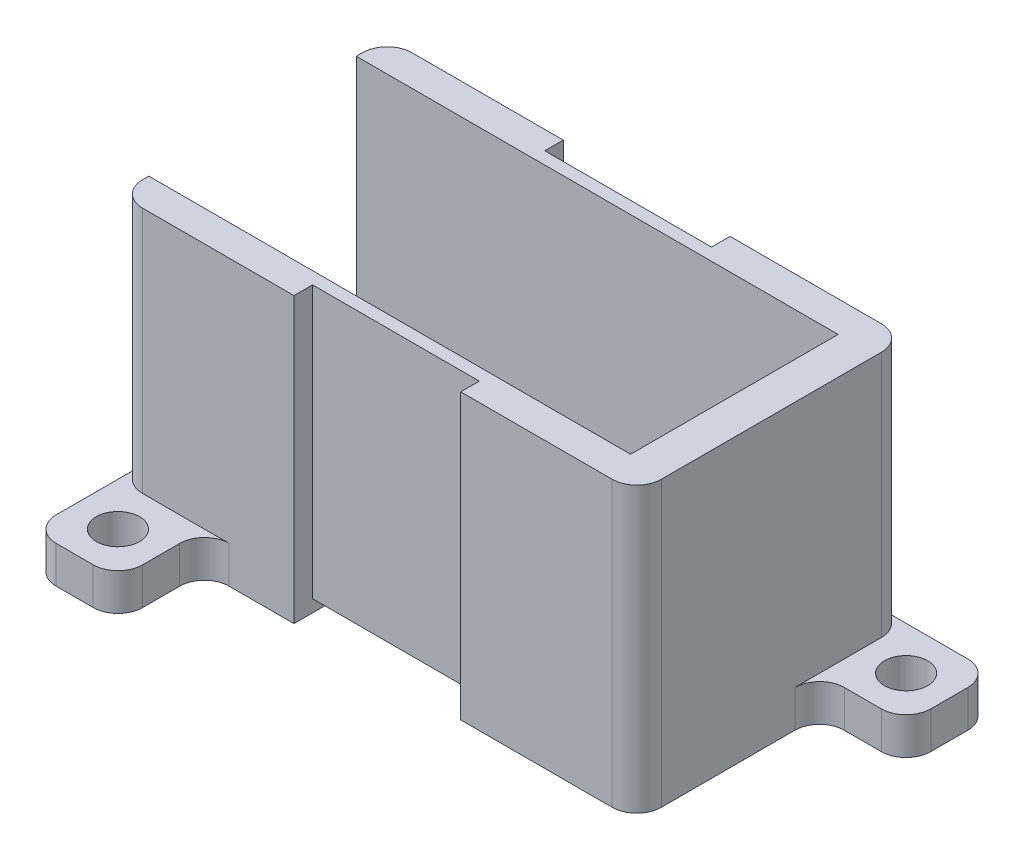
ISO-10303-21;
HEADER;
FILE_DESCRIPTION(('STEP AP214'),'2;1');
FILE_NAME('part.step','',(''),(''),'','','');
FILE_SCHEMA(('AUTOMOTIVE_DESIGN { 1 0 10303 214 1 1 1 1 }'));
ENDSEC;
DATA;
#1=APPLICATION_CONTEXT('core data for automotive mechanical design processes');
#2=APPLICATION_PROTOCOL_DEFINITION('international standard','automotive_design',2000,#1);
#3=PRODUCT_CONTEXT('',#1,'mechanical');
#4=PRODUCT('Part','Part','',(#3));
#5=PRODUCT_RELATED_PRODUCT_CATEGORY('part','',(#4));
#6=PRODUCT_DEFINITION_FORMATION('','',#4);
#7=PRODUCT_DEFINITION_CONTEXT('part definition',#1,'design');
#8=PRODUCT_DEFINITION('design','',#6,#7);
#9=PRODUCT_DEFINITION_SHAPE('','',#8);
#10=(LENGTH_UNIT() NAMED_UNIT(*) SI_UNIT(.MILLI.,.METRE.));
#11=(NAMED_UNIT(*) PLANE_ANGLE_UNIT() SI_UNIT($,.RADIAN.));
#12=(NAMED_UNIT(*) SI_UNIT($,.STERADIAN.) SOLID_ANGLE_UNIT());
#13=UNCERTAINTY_MEASURE_WITH_UNIT(LENGTH_MEASURE(1.E-05),#10,'distance_accuracy_value','');
#14=(GEOMETRIC_REPRESENTATION_CONTEXT(3) GLOBAL_UNCERTAINTY_ASSIGNED_CONTEXT((#13)) GLOBAL_UNIT_ASSIGNED_CONTEXT((#10,
#11,#12)) REPRESENTATION_CONTEXT('',''));
#15=CARTESIAN_POINT('',(0.,0.,0.));
#16=DIRECTION('',(0.,0.,1.));
#17=DIRECTION('',(1.,0.,0.));
#18=AXIS2_PLACEMENT_3D('',#15,#16,#17);
#19=CARTESIAN_POINT('',(33.,3.,0.));
#20=DIRECTION('',(-1.,0.,0.));
#21=DIRECTION('',(0.,0.,1.));
#22=AXIS2_PLACEMENT_3D('',#19,#20,#21);
#23=PLANE('',#22);
#24=DIRECTION('',(0.,0.,1.));
#25=VECTOR('',#24,1.);
#26=CARTESIAN_POINT('',(33.,23.,0.));
#27=LINE('',#26,#25);
#28=CARTESIAN_POINT('',(33.,23.,-28.4));
#29=VERTEX_POINT('',#28);
#30=CARTESIAN_POINT('',(33.,23.,-10.6));
#31=VERTEX_POINT('',#30);
#32=EDGE_CURVE('E477',#29,#31,#27,.T.);
#33=ORIENTED_EDGE('',*,*,#32,.T.);
#34=DIRECTION('',(0.,-1.,0.));
#35=VECTOR('',#34,1.);
#36=CARTESIAN_POINT('',(33.,3.,-10.6));
#37=LINE('',#36,#35);
#38=CARTESIAN_POINT('',(33.,0.,-10.6));
#39=VERTEX_POINT('',#38);
#40=EDGE_CURVE('E347',#31,#39,#37,.T.);
#41=ORIENTED_EDGE('',*,*,#40,.T.);
#42=DIRECTION('',(0.,0.,-1.));
#43=VECTOR('',#42,1.);
#44=CARTESIAN_POINT('',(33.,0.,0.));
#45=LINE('',#44,#43);
#46=CARTESIAN_POINT('',(33.,0.,-21.4));
#47=VERTEX_POINT('',#46);
#48=EDGE_CURVE('E278',#39,#47,#45,.T.);
#49=ORIENTED_EDGE('',*,*,#48,.T.);
#50=DIRECTION('',(0.,-1.,0.));
#51=VECTOR('',#50,1.);
#52=CARTESIAN_POINT('',(33.,3.,-21.4));
#53=LINE('',#52,#51);
#54=CARTESIAN_POINT('',(33.,3.,-21.4));
#55=VERTEX_POINT('',#54);
#56=EDGE_CURVE('E342',#47,#55,#53,.F.);
#57=ORIENTED_EDGE('',*,*,#56,.T.);
#58=DIRECTION('',(0.,0.,-1.));
#59=VECTOR('',#58,1.);
#60=CARTESIAN_POINT('',(33.,3.,0.));
#61=LINE('',#60,#59);
#62=CARTESIAN_POINT('',(33.,3.,-28.4));
#63=VERTEX_POINT('',#62);
#64=EDGE_CURVE('E404',#55,#63,#61,.T.);
#65=ORIENTED_EDGE('',*,*,#64,.T.);
#66=DIRECTION('',(0.,-1.,0.));
#67=VECTOR('',#66,1.);
#68=CARTESIAN_POINT('',(33.,23.,-28.4));
#69=LINE('',#68,#67);
#70=EDGE_CURVE('E345',#63,#29,#69,.F.);
#71=ORIENTED_EDGE('',*,*,#70,.T.);
#72=EDGE_LOOP('',(#33,#41,#49,#57,#65,#71));
#73=FACE_BOUND('',#72,.T.);
#74=ADVANCED_FACE('F43',(#73),#23,.F.);
#75=CARTESIAN_POINT('',(0.,3.,-8.6));
#76=DIRECTION('',(0.,0.,-1.));
#77=DIRECTION('',(-1.,0.,0.));
#78=AXIS2_PLACEMENT_3D('',#75,#76,#77);
#79=PLANE('',#78);
#80=DIRECTION('',(-1.,0.,0.));
#81=VECTOR('',#80,1.);
#82=CARTESIAN_POINT('',(0.,23.,-8.6));
#83=LINE('',#82,#81);
#84=CARTESIAN_POINT('',(5.25,23.,-8.6));
#85=VERTEX_POINT('',#84);
#86=CARTESIAN_POINT('',(-7.00000000000001,23.,-8.6));
#87=VERTEX_POINT('',#86);
#88=EDGE_CURVE('E464',#85,#87,#83,.T.);
#89=ORIENTED_EDGE('',*,*,#88,.T.);
#90=DIRECTION('',(0.,-1.,0.));
#91=VECTOR('',#90,1.);
#92=CARTESIAN_POINT('',(-7.00000000000001,3.,-8.6));
#93=LINE('',#92,#91);
#94=CARTESIAN_POINT('',(-7.00000000000001,3.,-8.6));
#95=VERTEX_POINT('',#94);
#96=EDGE_CURVE('E325',#87,#95,#93,.T.);
#97=ORIENTED_EDGE('',*,*,#96,.T.);
#98=DIRECTION('',(-1.,0.,0.));
#99=VECTOR('',#98,1.);
#100=CARTESIAN_POINT('',(0.,3.,-8.6));
#101=LINE('',#100,#99);
#102=CARTESIAN_POINT('',(0.,3.,-8.6));
#103=VERTEX_POINT('',#102);
#104=EDGE_CURVE('E262',#103,#95,#101,.T.);
#105=ORIENTED_EDGE('',*,*,#104,.F.);
#106=DIRECTION('',(0.,-1.,0.));
#107=VECTOR('',#106,1.);
#108=CARTESIAN_POINT('',(0.,0.,-8.6));
#109=LINE('',#108,#107);
#110=CARTESIAN_POINT('',(0.,0.,-8.6));
#111=VERTEX_POINT('',#110);
#112=EDGE_CURVE('E322',#103,#111,#109,.T.);
#113=ORIENTED_EDGE('',*,*,#112,.T.);
#114=DIRECTION('',(1.,0.,0.));
#115=VECTOR('',#114,1.);
#116=CARTESIAN_POINT('',(0.,0.,-8.6));
#117=LINE('',#116,#115);
#118=CARTESIAN_POINT('',(5.25,0.,-8.6));
#119=VERTEX_POINT('',#118);
#120=EDGE_CURVE('E291',#111,#119,#117,.T.);
#121=ORIENTED_EDGE('',*,*,#120,.T.);
#122=DIRECTION('',(0.,-1.,0.));
#123=VECTOR('',#122,1.);
#124=CARTESIAN_POINT('',(5.25,23.,-8.6));
#125=LINE('',#124,#123);
#126=EDGE_CURVE('E500',#85,#119,#125,.T.);
#127=ORIENTED_EDGE('',*,*,#126,.F.);
#128=EDGE_LOOP('',(#89,#97,#105,#113,#121,#127));
#129=FACE_BOUND('',#128,.T.);
#130=ADVANCED_FACE('F575',(#129),#79,.F.);
#131=CARTESIAN_POINT('',(0.,0.,0.));
#132=DIRECTION('',(0.,1.,0.));
#133=DIRECTION('',(0.,0.,1.));
#134=AXIS2_PLACEMENT_3D('',#131,#132,#133);
#135=PLANE('',#134);
#136=DIRECTION('',(0.,0.,1.));
#137=VECTOR('',#136,1.);
#138=CARTESIAN_POINT('',(-9.00000000000001,0.,0.));
#139=LINE('',#138,#137);
#140=CARTESIAN_POINT('',(-9.,0.,-28.4));
#141=VERTEX_POINT('',#140);
#142=CARTESIAN_POINT('',(-9.00000000000001,0.,-3.6));
#143=VERTEX_POINT('',#142);
#144=EDGE_CURVE('E295',#141,#143,#139,.T.);
#145=ORIENTED_EDGE('',*,*,#144,.F.);
#146=CARTESIAN_POINT('',(-7.,0.,-28.4));
#147=DIRECTION('',(0.,1.,0.));
#148=DIRECTION('',(0.,0.,1.));
#149=AXIS2_PLACEMENT_3D('',#146,#147,#148);
#150=CIRCLE('',#149,2.);
#151=CARTESIAN_POINT('',(-7.,0.,-30.4));
#152=VERTEX_POINT('',#151);
#153=EDGE_CURVE('E310',#141,#152,#150,.F.);
#154=ORIENTED_EDGE('',*,*,#153,.T.);
#155=DIRECTION('',(1.,0.,0.));
#156=VECTOR('',#155,1.);
#157=CARTESIAN_POINT('',(0.,0.,-30.4));
#158=LINE('',#157,#156);
#159=CARTESIAN_POINT('',(5.25,0.,-30.4));
#160=VERTEX_POINT('',#159);
#161=EDGE_CURVE('E293',#152,#160,#158,.T.);
#162=ORIENTED_EDGE('',*,*,#161,.T.);
#163=DIRECTION('',(0.,0.,-1.));
#164=VECTOR('',#163,1.);
#165=CARTESIAN_POINT('',(5.25,0.,0.));
#166=LINE('',#165,#164);
#167=EDGE_CURVE('E442',#119,#160,#166,.T.);
#168=ORIENTED_EDGE('',*,*,#167,.F.);
#169=ORIENTED_EDGE('',*,*,#120,.F.);
#170=CARTESIAN_POINT('',(0.,0.,-6.6));
#171=DIRECTION('',(0.,1.,0.));
#172=DIRECTION('',(0.,0.,1.));
#173=AXIS2_PLACEMENT_3D('',#170,#171,#172);
#174=CIRCLE('',#173,2.);
#175=CARTESIAN_POINT('',(-2.00000000000001,0.,-6.6));
#176=VERTEX_POINT('',#175);
#177=EDGE_CURVE('E380',#111,#176,#174,.T.);
#178=ORIENTED_EDGE('',*,*,#177,.T.);
#179=DIRECTION('',(0.,0.,-1.));
#180=VECTOR('',#179,1.);
#181=CARTESIAN_POINT('',(-2.00000000000001,0.,0.));
#182=LINE('',#181,#180);
#183=CARTESIAN_POINT('',(-2.00000000000001,0.,-3.6));
#184=VERTEX_POINT('',#183);
#185=EDGE_CURVE('E417',#184,#176,#182,.T.);
#186=ORIENTED_EDGE('',*,*,#185,.F.);
#187=CARTESIAN_POINT('',(-4.00000000000001,0.,-3.6));
#188=DIRECTION('',(0.,1.,0.));
#189=DIRECTION('',(0.,0.,1.));
#190=AXIS2_PLACEMENT_3D('',#187,#188,#189);
#191=CIRCLE('',#190,2.);
#192=CARTESIAN_POINT('',(-4.00000000000001,0.,-1.6));
#193=VERTEX_POINT('',#192);
#194=EDGE_CURVE('E306',#184,#193,#191,.F.);
#195=ORIENTED_EDGE('',*,*,#194,.T.);
#196=DIRECTION('',(-1.,0.,0.));
#197=VECTOR('',#196,1.);
#198=CARTESIAN_POINT('',(0.,0.,-1.6));
#199=LINE('',#198,#197);
#200=CARTESIAN_POINT('',(-7.00000000000001,0.,-1.6));
#201=VERTEX_POINT('',#200);
#202=EDGE_CURVE('E422',#193,#201,#199,.T.);
#203=ORIENTED_EDGE('',*,*,#202,.T.);
#204=CARTESIAN_POINT('',(-7.00000000000001,0.,-3.6));
#205=DIRECTION('',(0.,1.,0.));
#206=DIRECTION('',(0.,0.,1.));
#207=AXIS2_PLACEMENT_3D('',#204,#205,#206);
#208=CIRCLE('',#207,2.);
#209=EDGE_CURVE('E308',#201,#143,#208,.F.);
#210=ORIENTED_EDGE('',*,*,#209,.T.);
#211=EDGE_LOOP('',(#145,#154,#162,#168,#169,#178,#186,#195,#203,#210));
#212=FACE_BOUND('',#211,.T.);
#213=CARTESIAN_POINT('',(-5.50000000000001,0.,-5.1));
#214=DIRECTION('',(0.,1.,0.));
#215=DIRECTION('',(0.,0.,1.));
#216=AXIS2_PLACEMENT_3D('',#213,#214,#215);
#217=CIRCLE('',#216,1.75);
#218=CARTESIAN_POINT('',(-5.50000000000001,0.,-3.35));
#219=VERTEX_POINT('',#218);
#220=EDGE_CURVE('E426',#219,#219,#217,.T.);
#221=ORIENTED_EDGE('',*,*,#220,.T.);
#222=EDGE_LOOP('',(#221));
#223=FACE_BOUND('',#222,.T.);
#224=ADVANCED_FACE('F544',(#212,#223),#135,.F.);
#225=ORIENTED_EDGE('',*,*,#48,.F.);
#226=CARTESIAN_POINT('',(31.,0.,-10.6));
#227=DIRECTION('',(0.,1.,0.));
#228=DIRECTION('',(0.,0.,1.));
#229=AXIS2_PLACEMENT_3D('',#226,#227,#228);
#230=CIRCLE('',#229,2.);
#231=CARTESIAN_POINT('',(31.,0.,-8.6));
#232=VERTEX_POINT('',#231);
#233=EDGE_CURVE('E354',#39,#232,#230,.F.);
#234=ORIENTED_EDGE('',*,*,#233,.T.);
#235=CARTESIAN_POINT('',(18.75,0.,-8.6));
#236=VERTEX_POINT('',#235);
#237=EDGE_CURVE('E298',#236,#232,#117,.T.);
#238=ORIENTED_EDGE('',*,*,#237,.F.);
#239=DIRECTION('',(0.,0.,-1.));
#240=VECTOR('',#239,1.);
#241=CARTESIAN_POINT('',(18.75,0.,0.));
#242=LINE('',#241,#240);
#243=CARTESIAN_POINT('',(18.75,0.,-30.4));
#244=VERTEX_POINT('',#243);
#245=EDGE_CURVE('E272',#236,#244,#242,.T.);
#246=ORIENTED_EDGE('',*,*,#245,.T.);
#247=CARTESIAN_POINT('',(38.,0.,-30.4));
#248=VERTEX_POINT('',#247);
#249=EDGE_CURVE('E282',#244,#248,#158,.T.);
#250=ORIENTED_EDGE('',*,*,#249,.T.);
#251=CARTESIAN_POINT('',(38.,0.,-28.4));
#252=DIRECTION('',(0.,1.,0.));
#253=DIRECTION('',(0.,0.,1.));
#254=AXIS2_PLACEMENT_3D('',#251,#252,#253);
#255=CIRCLE('',#254,2.);
#256=CARTESIAN_POINT('',(40.,0.,-28.4));
#257=VERTEX_POINT('',#256);
#258=EDGE_CURVE('E350',#248,#257,#255,.F.);
#259=ORIENTED_EDGE('',*,*,#258,.T.);
#260=DIRECTION('',(0.,0.,-1.));
#261=VECTOR('',#260,1.);
#262=CARTESIAN_POINT('',(40.,0.,0.));
#263=LINE('',#262,#261);
#264=CARTESIAN_POINT('',(40.,0.,-25.4));
#265=VERTEX_POINT('',#264);
#266=EDGE_CURVE('E403',#265,#257,#263,.T.);
#267=ORIENTED_EDGE('',*,*,#266,.F.);
#268=CARTESIAN_POINT('',(38.,0.,-25.4));
#269=DIRECTION('',(0.,1.,0.));
#270=DIRECTION('',(0.,0.,1.));
#271=AXIS2_PLACEMENT_3D('',#268,#269,#270);
#272=CIRCLE('',#271,2.);
#273=CARTESIAN_POINT('',(38.,0.,-23.4));
#274=VERTEX_POINT('',#273);
#275=EDGE_CURVE('E352',#265,#274,#272,.F.);
#276=ORIENTED_EDGE('',*,*,#275,.T.);
#277=DIRECTION('',(-1.,0.,0.));
#278=VECTOR('',#277,1.);
#279=CARTESIAN_POINT('',(0.,0.,-23.4));
#280=LINE('',#279,#278);
#281=CARTESIAN_POINT('',(35.,0.,-23.4));
#282=VERTEX_POINT('',#281);
#283=EDGE_CURVE('E391',#274,#282,#280,.T.);
#284=ORIENTED_EDGE('',*,*,#283,.T.);
#285=CARTESIAN_POINT('',(35.,0.,-21.4));
#286=DIRECTION('',(0.,1.,0.));
#287=DIRECTION('',(0.,0.,1.));
#288=AXIS2_PLACEMENT_3D('',#285,#286,#287);
#289=CIRCLE('',#288,2.);
#290=EDGE_CURVE('E51',#282,#47,#289,.T.);
#291=ORIENTED_EDGE('',*,*,#290,.T.);
#292=EDGE_LOOP('',(#225,#234,#238,#246,#250,#259,#267,#276,#284,#291));
#293=FACE_BOUND('',#292,.T.);
#294=CARTESIAN_POINT('',(36.5,0.,-26.9));
#295=DIRECTION('',(0.,1.,0.));
#296=DIRECTION('',(0.,0.,1.));
#297=AXIS2_PLACEMENT_3D('',#294,#295,#296);
#298=CIRCLE('',#297,1.75);
#299=CARTESIAN_POINT('',(36.5,0.,-25.15));
#300=VERTEX_POINT('',#299);
#301=EDGE_CURVE('E621',#300,#300,#298,.T.);
#302=ORIENTED_EDGE('',*,*,#301,.T.);
#303=EDGE_LOOP('',(#302));
#304=FACE_BOUND('',#303,.T.);
#305=ADVANCED_FACE('F389',(#293,#304),#135,.F.);
#306=CARTESIAN_POINT('',(0.,3.,-30.4));
#307=DIRECTION('',(0.,0.,-1.));
#308=DIRECTION('',(-1.,0.,0.));
#309=AXIS2_PLACEMENT_3D('',#306,#307,#308);
#310=PLANE('',#309);
#311=ORIENTED_EDGE('',*,*,#161,.F.);
#312=DIRECTION('',(0.,-1.,0.));
#313=VECTOR('',#312,1.);
#314=CARTESIAN_POINT('',(-7.,23.,-30.4));
#315=LINE('',#314,#313);
#316=CARTESIAN_POINT('',(-7.,23.,-30.4));
#317=VERTEX_POINT('',#316);
#318=EDGE_CURVE('E312',#152,#317,#315,.F.);
#319=ORIENTED_EDGE('',*,*,#318,.T.);
#320=DIRECTION('',(-1.,0.,0.));
#321=VECTOR('',#320,1.);
#322=CARTESIAN_POINT('',(0.,23.,-30.4));
#323=LINE('',#322,#321);
#324=CARTESIAN_POINT('',(5.25,23.,-30.4));
#325=VERTEX_POINT('',#324);
#326=EDGE_CURVE('E450',#325,#317,#323,.T.);
#327=ORIENTED_EDGE('',*,*,#326,.F.);
#328=DIRECTION('',(0.,-1.,0.));
#329=VECTOR('',#328,1.);
#330=CARTESIAN_POINT('',(5.25,23.,-30.4));
#331=LINE('',#330,#329);
#332=EDGE_CURVE('E279',#325,#160,#331,.T.);
#333=ORIENTED_EDGE('',*,*,#332,.T.);
#334=EDGE_LOOP('',(#311,#319,#327,#333));
#335=FACE_BOUND('',#334,.T.);
#336=ADVANCED_FACE('F804',(#335),#310,.T.);
#337=ORIENTED_EDGE('',*,*,#237,.T.);
#338=DIRECTION('',(0.,-1.,0.));
#339=VECTOR('',#338,1.);
#340=CARTESIAN_POINT('',(31.,3.,-8.6));
#341=LINE('',#340,#339);
#342=CARTESIAN_POINT('',(31.,23.,-8.6));
#343=VERTEX_POINT('',#342);
#344=EDGE_CURVE('E356',#232,#343,#341,.F.);
#345=ORIENTED_EDGE('',*,*,#344,.T.);
#346=DIRECTION('',(-1.,0.,0.));
#347=VECTOR('',#346,1.);
#348=CARTESIAN_POINT('',(0.,23.,-8.6));
#349=LINE('',#348,#347);
#350=CARTESIAN_POINT('',(18.75,23.,-8.6));
#351=VERTEX_POINT('',#350);
#352=EDGE_CURVE('E475',#343,#351,#349,.T.);
#353=ORIENTED_EDGE('',*,*,#352,.T.);
#354=DIRECTION('',(0.,-1.,0.));
#355=VECTOR('',#354,1.);
#356=CARTESIAN_POINT('',(18.75,23.,-8.6));
#357=LINE('',#356,#355);
#358=EDGE_CURVE('E493',#351,#236,#357,.T.);
#359=ORIENTED_EDGE('',*,*,#358,.T.);
#360=EDGE_LOOP('',(#337,#345,#353,#359));
#361=FACE_BOUND('',#360,.T.);
#362=ADVANCED_FACE('F594',(#361),#79,.F.);
#363=CARTESIAN_POINT('',(0.,3.,0.));
#364=DIRECTION('',(0.,1.,0.));
#365=DIRECTION('',(0.,0.,1.));
#366=AXIS2_PLACEMENT_3D('',#363,#364,#365);
#367=PLANE('',#366);
#368=DIRECTION('',(-1.,0.,0.));
#369=VECTOR('',#368,1.);
#370=CARTESIAN_POINT('',(0.,3.,-11.1));
#371=LINE('',#370,#369);
#372=CARTESIAN_POINT('',(30.,3.,-11.1));
#373=VERTEX_POINT('',#372);
#374=CARTESIAN_POINT('',(-9.00000000000001,3.,-11.1));
#375=VERTEX_POINT('',#374);
#376=EDGE_CURVE('E448',#373,#375,#371,.T.);
#377=ORIENTED_EDGE('',*,*,#376,.F.);
#378=DIRECTION('',(0.,0.,1.));
#379=VECTOR('',#378,1.);
#380=CARTESIAN_POINT('',(30.,3.,0.));
#381=LINE('',#380,#379);
#382=CARTESIAN_POINT('',(30.,3.,-27.9));
#383=VERTEX_POINT('',#382);
#384=EDGE_CURVE('E485',#383,#373,#381,.T.);
#385=ORIENTED_EDGE('',*,*,#384,.F.);
#386=DIRECTION('',(1.,0.,0.));
#387=VECTOR('',#386,1.);
#388=CARTESIAN_POINT('',(0.,3.,-27.9));
#389=LINE('',#388,#387);
#390=CARTESIAN_POINT('',(-9.,3.,-27.9));
#391=VERTEX_POINT('',#390);
#392=EDGE_CURVE('E445',#391,#383,#389,.T.);
#393=ORIENTED_EDGE('',*,*,#392,.F.);
#394=DIRECTION('',(0.,0.,1.));
#395=VECTOR('',#394,1.);
#396=CARTESIAN_POINT('',(-9.00000000000001,3.,0.));
#397=LINE('',#396,#395);
#398=EDGE_CURVE('E289',#391,#375,#397,.T.);
#399=ORIENTED_EDGE('',*,*,#398,.T.);
#400=EDGE_LOOP('',(#377,#385,#393,#399));
#401=FACE_BOUND('',#400,.T.);
#402=ADVANCED_FACE('F524',(#401),#367,.T.);
#403=DIRECTION('',(-1.,0.,0.));
#404=VECTOR('',#403,1.);
#405=CARTESIAN_POINT('',(0.,23.,-30.4));
#406=LINE('',#405,#404);
#407=CARTESIAN_POINT('',(31.,23.,-30.4));
#408=VERTEX_POINT('',#407);
#409=CARTESIAN_POINT('',(18.75,23.,-30.4));
#410=VERTEX_POINT('',#409);
#411=EDGE_CURVE('E479',#408,#410,#406,.T.);
#412=ORIENTED_EDGE('',*,*,#411,.F.);
#413=DIRECTION('',(0.,-1.,0.));
#414=VECTOR('',#413,1.);
#415=CARTESIAN_POINT('',(31.,3.,-30.4));
#416=LINE('',#415,#414);
#417=CARTESIAN_POINT('',(31.,3.,-30.4));
#418=VERTEX_POINT('',#417);
#419=EDGE_CURVE('E361',#408,#418,#416,.T.);
#420=ORIENTED_EDGE('',*,*,#419,.T.);
#421=DIRECTION('',(-1.,0.,0.));
#422=VECTOR('',#421,1.);
#423=CARTESIAN_POINT('',(0.,3.,-30.4));
#424=LINE('',#423,#422);
#425=CARTESIAN_POINT('',(38.,3.,-30.4));
#426=VERTEX_POINT('',#425);
#427=EDGE_CURVE('E414',#426,#418,#424,.T.);
#428=ORIENTED_EDGE('',*,*,#427,.F.);
#429=DIRECTION('',(0.,-1.,0.));
#430=VECTOR('',#429,1.);
#431=CARTESIAN_POINT('',(38.,0.,-30.4));
#432=LINE('',#431,#430);
#433=EDGE_CURVE('E358',#426,#248,#432,.T.);
#434=ORIENTED_EDGE('',*,*,#433,.T.);
#435=ORIENTED_EDGE('',*,*,#249,.F.);
#436=DIRECTION('',(0.,-1.,0.));
#437=VECTOR('',#436,1.);
#438=CARTESIAN_POINT('',(18.75,23.,-30.4));
#439=LINE('',#438,#437);
#440=EDGE_CURVE('E491',#410,#244,#439,.T.);
#441=ORIENTED_EDGE('',*,*,#440,.F.);
#442=EDGE_LOOP('',(#412,#420,#428,#434,#435,#441));
#443=FACE_BOUND('',#442,.T.);
#444=ADVANCED_FACE('F605',(#443),#310,.T.);
#445=CARTESIAN_POINT('',(-9.00000000000001,3.,0.));
#446=DIRECTION('',(1.,0.,0.));
#447=DIRECTION('',(0.,0.,-1.));
#448=AXIS2_PLACEMENT_3D('',#445,#446,#447);
#449=PLANE('',#448);
#450=DIRECTION('',(0.,0.,1.));
#451=VECTOR('',#450,1.);
#452=CARTESIAN_POINT('',(-8.99999999999994,23.,0.));
#453=LINE('',#452,#451);
#454=CARTESIAN_POINT('',(-9.,23.,-28.4));
#455=VERTEX_POINT('',#454);
#456=CARTESIAN_POINT('',(-9.,23.,-27.9));
#457=VERTEX_POINT('',#456);
#458=EDGE_CURVE('E453',#455,#457,#453,.T.);
#459=ORIENTED_EDGE('',*,*,#458,.F.);
#460=DIRECTION('',(0.,-1.,0.));
#461=VECTOR('',#460,1.);
#462=CARTESIAN_POINT('',(-9.,0.,-28.4));
#463=LINE('',#462,#461);
#464=EDGE_CURVE('E303',#455,#141,#463,.T.);
#465=ORIENTED_EDGE('',*,*,#464,.T.);
#466=ORIENTED_EDGE('',*,*,#144,.T.);
#467=DIRECTION('',(0.,-1.,0.));
#468=VECTOR('',#467,1.);
#469=CARTESIAN_POINT('',(-9.00000000000001,3.,-3.6));
#470=LINE('',#469,#468);
#471=CARTESIAN_POINT('',(-9.00000000000001,3.,-3.6));
#472=VERTEX_POINT('',#471);
#473=EDGE_CURVE('E290',#143,#472,#470,.F.);
#474=ORIENTED_EDGE('',*,*,#473,.T.);
#475=DIRECTION('',(0.,0.,-1.));
#476=VECTOR('',#475,1.);
#477=CARTESIAN_POINT('',(-9.00000000000001,3.,0.));
#478=LINE('',#477,#476);
#479=CARTESIAN_POINT('',(-9.00000000000001,3.,-10.6));
#480=VERTEX_POINT('',#479);
#481=EDGE_CURVE('E416',#472,#480,#478,.T.);
#482=ORIENTED_EDGE('',*,*,#481,.T.);
#483=DIRECTION('',(0.,-1.,0.));
#484=VECTOR('',#483,1.);
#485=CARTESIAN_POINT('',(-9.00000000000001,3.,-10.6));
#486=LINE('',#485,#484);
#487=CARTESIAN_POINT('',(-9.00000000000001,23.,-10.6));
#488=VERTEX_POINT('',#487);
#489=EDGE_CURVE('E301',#480,#488,#486,.F.);
#490=ORIENTED_EDGE('',*,*,#489,.T.);
#491=DIRECTION('',(0.,0.,-1.));
#492=VECTOR('',#491,1.);
#493=CARTESIAN_POINT('',(-9.00000000000001,23.,0.));
#494=LINE('',#493,#492);
#495=CARTESIAN_POINT('',(-9.00000000000001,23.,-11.1));
#496=VERTEX_POINT('',#495);
#497=EDGE_CURVE('E462',#488,#496,#494,.T.);
#498=ORIENTED_EDGE('',*,*,#497,.T.);
#499=DIRECTION('',(0.,-1.,0.));
#500=VECTOR('',#499,1.);
#501=CARTESIAN_POINT('',(-9.00000000000001,23.,-11.1));
#502=LINE('',#501,#500);
#503=EDGE_CURVE('E503',#496,#375,#502,.T.);
#504=ORIENTED_EDGE('',*,*,#503,.T.);
#505=ORIENTED_EDGE('',*,*,#398,.F.);
#506=DIRECTION('',(0.,-1.,0.));
#507=VECTOR('',#506,1.);
#508=CARTESIAN_POINT('',(-9.,23.,-27.9));
#509=LINE('',#508,#507);
#510=EDGE_CURVE('E285',#457,#391,#509,.T.);
#511=ORIENTED_EDGE('',*,*,#510,.F.);
#512=EDGE_LOOP('',(#459,#465,#466,#474,#482,#490,#498,#504,#505,#511));
#513=FACE_BOUND('',#512,.T.);
#514=ADVANCED_FACE('F520',(#513),#449,.F.);
#515=CARTESIAN_POINT('',(0.,23.,-28.9));
#516=DIRECTION('',(0.,0.,1.));
#517=DIRECTION('',(1.,0.,0.));
#518=AXIS2_PLACEMENT_3D('',#515,#516,#517);
#519=PLANE('',#518);
#520=DIRECTION('',(0.,-1.,0.));
#521=VECTOR('',#520,1.);
#522=CARTESIAN_POINT('',(18.75,23.,-28.9));
#523=LINE('',#522,#521);
#524=CARTESIAN_POINT('',(18.75,23.,-28.9));
#525=VERTEX_POINT('',#524);
#526=CARTESIAN_POINT('',(18.75,1.,-28.9));
#527=VERTEX_POINT('',#526);
#528=EDGE_CURVE('E271',#525,#527,#523,.T.);
#529=ORIENTED_EDGE('',*,*,#528,.T.);
#530=DIRECTION('',(-1.,0.,0.));
#531=VECTOR('',#530,1.);
#532=CARTESIAN_POINT('',(0.,1.,-28.9));
#533=LINE('',#532,#531);
#534=CARTESIAN_POINT('',(5.25,1.,-28.9));
#535=VERTEX_POINT('',#534);
#536=EDGE_CURVE('E253',#527,#535,#533,.T.);
#537=ORIENTED_EDGE('',*,*,#536,.T.);
#538=DIRECTION('',(0.,-1.,0.));
#539=VECTOR('',#538,1.);
#540=CARTESIAN_POINT('',(5.25,23.,-28.9));
#541=LINE('',#540,#539);
#542=CARTESIAN_POINT('',(5.25,23.,-28.9));
#543=VERTEX_POINT('',#542);
#544=EDGE_CURVE('E269',#543,#535,#541,.T.);
#545=ORIENTED_EDGE('',*,*,#544,.F.);
#546=DIRECTION('',(-1.,0.,0.));
#547=VECTOR('',#546,1.);
#548=CARTESIAN_POINT('',(0.,23.,-28.9));
#549=LINE('',#548,#547);
#550=EDGE_CURVE('E446',#525,#543,#549,.T.);
#551=ORIENTED_EDGE('',*,*,#550,.F.);
#552=EDGE_LOOP('',(#529,#537,#545,#551));
#553=FACE_BOUND('',#552,.T.);
#554=ADVANCED_FACE('F267',(#553),#519,.F.);
#555=CARTESIAN_POINT('',(5.25,23.,0.));
#556=DIRECTION('',(-1.,0.,0.));
#557=DIRECTION('',(0.,0.,1.));
#558=AXIS2_PLACEMENT_3D('',#555,#556,#557);
#559=PLANE('',#558);
#560=ORIENTED_EDGE('',*,*,#544,.T.);
#561=DIRECTION('',(0.,0.,1.));
#562=VECTOR('',#561,1.);
#563=CARTESIAN_POINT('',(5.25,1.,0.));
#564=LINE('',#563,#562);
#565=CARTESIAN_POINT('',(5.25,1.,-10.1));
#566=VERTEX_POINT('',#565);
#567=EDGE_CURVE('E250',#535,#566,#564,.T.);
#568=ORIENTED_EDGE('',*,*,#567,.T.);
#569=DIRECTION('',(0.,-1.,0.));
#570=VECTOR('',#569,1.);
#571=CARTESIAN_POINT('',(5.25,23.,-10.1));
#572=LINE('',#571,#570);
#573=CARTESIAN_POINT('',(5.25,23.,-10.1));
#574=VERTEX_POINT('',#573);
#575=EDGE_CURVE('E498',#574,#566,#572,.T.);
#576=ORIENTED_EDGE('',*,*,#575,.F.);
#577=DIRECTION('',(0.,0.,-1.));
#578=VECTOR('',#577,1.);
#579=CARTESIAN_POINT('',(5.25,23.,0.));
#580=LINE('',#579,#578);
#581=EDGE_CURVE('E467',#85,#574,#580,.T.);
#582=ORIENTED_EDGE('',*,*,#581,.F.);
#583=ORIENTED_EDGE('',*,*,#126,.T.);
#584=ORIENTED_EDGE('',*,*,#167,.T.);
#585=ORIENTED_EDGE('',*,*,#332,.F.);
#586=DIRECTION('',(0.,0.,-1.));
#587=VECTOR('',#586,1.);
#588=CARTESIAN_POINT('',(5.25,23.,0.));
#589=LINE('',#588,#587);
#590=EDGE_CURVE('E276',#543,#325,#589,.T.);
#591=ORIENTED_EDGE('',*,*,#590,.F.);
#592=EDGE_LOOP('',(#560,#568,#576,#582,#583,#584,#585,#591));
#593=FACE_BOUND('',#592,.T.);
#594=ADVANCED_FACE('F274',(#593),#559,.F.);
#595=CARTESIAN_POINT('',(0.,23.,-27.9));
#596=DIRECTION('',(0.,0.,-1.));
#597=DIRECTION('',(-1.,0.,0.));
#598=AXIS2_PLACEMENT_3D('',#595,#596,#597);
#599=PLANE('',#598);
#600=ORIENTED_EDGE('',*,*,#392,.T.);
#601=DIRECTION('',(0.,-1.,0.));
#602=VECTOR('',#601,1.);
#603=CARTESIAN_POINT('',(30.,23.,-27.9));
#604=LINE('',#603,#602);
#605=CARTESIAN_POINT('',(30.,23.,-27.9));
#606=VERTEX_POINT('',#605);
#607=EDGE_CURVE('E509',#606,#383,#604,.T.);
#608=ORIENTED_EDGE('',*,*,#607,.F.);
#609=DIRECTION('',(1.,0.,0.));
#610=VECTOR('',#609,1.);
#611=CARTESIAN_POINT('',(0.,23.,-27.9));
#612=LINE('',#611,#610);
#613=EDGE_CURVE('E455',#457,#606,#612,.T.);
#614=ORIENTED_EDGE('',*,*,#613,.F.);
#615=ORIENTED_EDGE('',*,*,#510,.T.);
#616=EDGE_LOOP('',(#600,#608,#614,#615));
#617=FACE_BOUND('',#616,.T.);
#618=ADVANCED_FACE('F515',(#617),#599,.F.);
#619=CARTESIAN_POINT('',(30.,23.,0.));
#620=DIRECTION('',(1.,0.,0.));
#621=DIRECTION('',(0.,0.,-1.));
#622=AXIS2_PLACEMENT_3D('',#619,#620,#621);
#623=PLANE('',#622);
#624=ORIENTED_EDGE('',*,*,#384,.T.);
#625=DIRECTION('',(0.,-1.,0.));
#626=VECTOR('',#625,1.);
#627=CARTESIAN_POINT('',(30.,23.,-11.1));
#628=LINE('',#627,#626);
#629=CARTESIAN_POINT('',(30.,23.,-11.1));
#630=VERTEX_POINT('',#629);
#631=EDGE_CURVE('E506',#630,#373,#628,.T.);
#632=ORIENTED_EDGE('',*,*,#631,.F.);
#633=DIRECTION('',(0.,0.,1.));
#634=VECTOR('',#633,1.);
#635=CARTESIAN_POINT('',(30.,23.,0.));
#636=LINE('',#635,#634);
#637=EDGE_CURVE('E457',#606,#630,#636,.T.);
#638=ORIENTED_EDGE('',*,*,#637,.F.);
#639=ORIENTED_EDGE('',*,*,#607,.T.);
#640=EDGE_LOOP('',(#624,#632,#638,#639));
#641=FACE_BOUND('',#640,.T.);
#642=ADVANCED_FACE('F527',(#641),#623,.F.);
#643=CARTESIAN_POINT('',(0.,23.,-11.1));
#644=DIRECTION('',(0.,0.,1.));
#645=DIRECTION('',(1.,0.,0.));
#646=AXIS2_PLACEMENT_3D('',#643,#644,#645);
#647=PLANE('',#646);
#648=ORIENTED_EDGE('',*,*,#376,.T.);
#649=ORIENTED_EDGE('',*,*,#503,.F.);
#650=DIRECTION('',(-1.,0.,0.));
#651=VECTOR('',#650,1.);
#652=CARTESIAN_POINT('',(0.,23.,-11.1));
#653=LINE('',#652,#651);
#654=EDGE_CURVE('E459',#630,#496,#653,.T.);
#655=ORIENTED_EDGE('',*,*,#654,.F.);
#656=ORIENTED_EDGE('',*,*,#631,.T.);
#657=EDGE_LOOP('',(#648,#649,#655,#656));
#658=FACE_BOUND('',#657,.T.);
#659=ADVANCED_FACE('F531',(#658),#647,.F.);
#660=CARTESIAN_POINT('',(0.,23.,-10.1));
#661=DIRECTION('',(0.,0.,1.));
#662=DIRECTION('',(1.,0.,0.));
#663=AXIS2_PLACEMENT_3D('',#660,#661,#662);
#664=PLANE('',#663);
#665=DIRECTION('',(-1.,0.,0.));
#666=VECTOR('',#665,1.);
#667=CARTESIAN_POINT('',(0.,1.,-10.1));
#668=LINE('',#667,#666);
#669=CARTESIAN_POINT('',(18.75,1.,-10.1));
#670=VERTEX_POINT('',#669);
#671=EDGE_CURVE('E256',#670,#566,#668,.T.);
#672=ORIENTED_EDGE('',*,*,#671,.F.);
#673=DIRECTION('',(0.,-1.,0.));
#674=VECTOR('',#673,1.);
#675=CARTESIAN_POINT('',(18.75,23.,-10.1));
#676=LINE('',#675,#674);
#677=CARTESIAN_POINT('',(18.75,23.,-10.1));
#678=VERTEX_POINT('',#677);
#679=EDGE_CURVE('E495',#678,#670,#676,.T.);
#680=ORIENTED_EDGE('',*,*,#679,.F.);
#681=DIRECTION('',(-1.,0.,0.));
#682=VECTOR('',#681,1.);
#683=CARTESIAN_POINT('',(0.,23.,-10.1));
#684=LINE('',#683,#682);
#685=EDGE_CURVE('E469',#678,#574,#684,.T.);
#686=ORIENTED_EDGE('',*,*,#685,.T.);
#687=ORIENTED_EDGE('',*,*,#575,.T.);
#688=EDGE_LOOP('',(#672,#680,#686,#687));
#689=FACE_BOUND('',#688,.T.);
#690=ADVANCED_FACE('F587',(#689),#664,.T.);
#691=CARTESIAN_POINT('',(18.75,23.,0.));
#692=DIRECTION('',(1.,0.,0.));
#693=DIRECTION('',(0.,0.,-1.));
#694=AXIS2_PLACEMENT_3D('',#691,#692,#693);
#695=PLANE('',#694);
#696=ORIENTED_EDGE('',*,*,#679,.T.);
#697=DIRECTION('',(0.,0.,-1.));
#698=VECTOR('',#697,1.);
#699=CARTESIAN_POINT('',(18.75,1.,0.));
#700=LINE('',#699,#698);
#701=EDGE_CURVE('E261',#670,#527,#700,.T.);
#702=ORIENTED_EDGE('',*,*,#701,.T.);
#703=ORIENTED_EDGE('',*,*,#528,.F.);
#704=DIRECTION('',(0.,0.,1.));
#705=VECTOR('',#704,1.);
#706=CARTESIAN_POINT('',(18.75,23.,0.));
#707=LINE('',#706,#705);
#708=EDGE_CURVE('E481',#410,#525,#707,.T.);
#709=ORIENTED_EDGE('',*,*,#708,.F.);
#710=ORIENTED_EDGE('',*,*,#440,.T.);
#711=ORIENTED_EDGE('',*,*,#245,.F.);
#712=ORIENTED_EDGE('',*,*,#358,.F.);
#713=DIRECTION('',(0.,0.,1.));
#714=VECTOR('',#713,1.);
#715=CARTESIAN_POINT('',(18.75,23.,0.));
#716=LINE('',#715,#714);
#717=EDGE_CURVE('E472',#678,#351,#716,.T.);
#718=ORIENTED_EDGE('',*,*,#717,.F.);
#719=EDGE_LOOP('',(#696,#702,#703,#709,#710,#711,#712,#718));
#720=FACE_BOUND('',#719,.T.);
#721=ADVANCED_FACE('F589',(#720),#695,.F.);
#722=CARTESIAN_POINT('',(0.,23.,0.));
#723=DIRECTION('',(0.,-1.,0.));
#724=DIRECTION('',(0.,0.,-1.));
#725=AXIS2_PLACEMENT_3D('',#722,#723,#724);
#726=PLANE('',#725);
#727=ORIENTED_EDGE('',*,*,#326,.T.);
#728=CARTESIAN_POINT('',(-7.,23.,-28.4));
#729=DIRECTION('',(0.,-1.,0.));
#730=DIRECTION('',(0.,0.,-1.));
#731=AXIS2_PLACEMENT_3D('',#728,#729,#730);
#732=CIRCLE('',#731,2.);
#733=EDGE_CURVE('E320',#317,#455,#732,.F.);
#734=ORIENTED_EDGE('',*,*,#733,.T.);
#735=ORIENTED_EDGE('',*,*,#458,.T.);
#736=ORIENTED_EDGE('',*,*,#613,.T.);
#737=ORIENTED_EDGE('',*,*,#637,.T.);
#738=ORIENTED_EDGE('',*,*,#654,.T.);
#739=ORIENTED_EDGE('',*,*,#497,.F.);
#740=CARTESIAN_POINT('',(-7.00000000000001,23.,-10.6));
#741=DIRECTION('',(0.,-1.,0.));
#742=DIRECTION('',(0.,0.,-1.));
#743=AXIS2_PLACEMENT_3D('',#740,#741,#742);
#744=CIRCLE('',#743,2.);
#745=EDGE_CURVE('E318',#488,#87,#744,.F.);
#746=ORIENTED_EDGE('',*,*,#745,.T.);
#747=ORIENTED_EDGE('',*,*,#88,.F.);
#748=ORIENTED_EDGE('',*,*,#581,.T.);
#749=ORIENTED_EDGE('',*,*,#685,.F.);
#750=ORIENTED_EDGE('',*,*,#717,.T.);
#751=ORIENTED_EDGE('',*,*,#352,.F.);
#752=CARTESIAN_POINT('',(31.,23.,-10.6));
#753=DIRECTION('',(0.,-1.,0.));
#754=DIRECTION('',(0.,0.,-1.));
#755=AXIS2_PLACEMENT_3D('',#752,#753,#754);
#756=CIRCLE('',#755,2.);
#757=EDGE_CURVE('E316',#343,#31,#756,.F.);
#758=ORIENTED_EDGE('',*,*,#757,.T.);
#759=ORIENTED_EDGE('',*,*,#32,.F.);
#760=CARTESIAN_POINT('',(31.,23.,-28.4));
#761=DIRECTION('',(0.,-1.,0.));
#762=DIRECTION('',(0.,0.,-1.));
#763=AXIS2_PLACEMENT_3D('',#760,#761,#762);
#764=CIRCLE('',#763,2.);
#765=EDGE_CURVE('E314',#29,#408,#764,.F.);
#766=ORIENTED_EDGE('',*,*,#765,.T.);
#767=ORIENTED_EDGE('',*,*,#411,.T.);
#768=ORIENTED_EDGE('',*,*,#708,.T.);
#769=ORIENTED_EDGE('',*,*,#550,.T.);
#770=ORIENTED_EDGE('',*,*,#590,.T.);
#771=EDGE_LOOP('',(#727,#734,#735,#736,#737,#738,#739,#746,#747,#748,#749,#750,#751,#758,#759,
#766,#767,#768,#769,#770));
#772=FACE_BOUND('',#771,.T.);
#773=ADVANCED_FACE('F534',(#772),#726,.F.);
#774=CARTESIAN_POINT('',(0.,1.,0.));
#775=DIRECTION('',(0.,1.,0.));
#776=DIRECTION('',(0.,0.,1.));
#777=AXIS2_PLACEMENT_3D('',#774,#775,#776);
#778=PLANE('',#777);
#779=ORIENTED_EDGE('',*,*,#701,.F.);
#780=ORIENTED_EDGE('',*,*,#671,.T.);
#781=ORIENTED_EDGE('',*,*,#567,.F.);
#782=ORIENTED_EDGE('',*,*,#536,.F.);
#783=EDGE_LOOP('',(#779,#780,#781,#782));
#784=FACE_BOUND('',#783,.T.);
#785=ADVANCED_FACE('F252',(#784),#778,.F.);
#786=CARTESIAN_POINT('',(0.,12.8994949366117,-1.6));
#787=DIRECTION('',(0.,0.,1.));
#788=DIRECTION('',(1.,0.,0.));
#789=AXIS2_PLACEMENT_3D('',#786,#787,#788);
#790=PLANE('',#789);
#791=DIRECTION('',(-1.,0.,0.));
#792=VECTOR('',#791,1.);
#793=CARTESIAN_POINT('',(0.,3.,-1.6));
#794=LINE('',#793,#792);
#795=CARTESIAN_POINT('',(-4.00000000000001,3.,-1.6));
#796=VERTEX_POINT('',#795);
#797=CARTESIAN_POINT('',(-7.00000000000001,3.,-1.6));
#798=VERTEX_POINT('',#797);
#799=EDGE_CURVE('E421',#796,#798,#794,.T.);
#800=ORIENTED_EDGE('',*,*,#799,.T.);
#801=DIRECTION('',(0.,-1.,0.));
#802=VECTOR('',#801,1.);
#803=CARTESIAN_POINT('',(-7.00000000000001,0.,-1.6));
#804=LINE('',#803,#802);
#805=EDGE_CURVE('E330',#798,#201,#804,.T.);
#806=ORIENTED_EDGE('',*,*,#805,.T.);
#807=ORIENTED_EDGE('',*,*,#202,.F.);
#808=DIRECTION('',(0.,-1.,0.));
#809=VECTOR('',#808,1.);
#810=CARTESIAN_POINT('',(-4.00000000000001,3.,-1.6));
#811=LINE('',#810,#809);
#812=EDGE_CURVE('E328',#193,#796,#811,.F.);
#813=ORIENTED_EDGE('',*,*,#812,.T.);
#814=EDGE_LOOP('',(#800,#806,#807,#813));
#815=FACE_BOUND('',#814,.T.);
#816=ADVANCED_FACE('F553',(#815),#790,.T.);
#817=CARTESIAN_POINT('',(-2.00000000000001,12.8994949366117,0.));
#818=DIRECTION('',(-1.,0.,0.));
#819=DIRECTION('',(0.,0.,1.));
#820=AXIS2_PLACEMENT_3D('',#817,#818,#819);
#821=PLANE('',#820);
#822=DIRECTION('',(0.,0.,-1.));
#823=VECTOR('',#822,1.);
#824=CARTESIAN_POINT('',(-2.00000000000001,3.,0.));
#825=LINE('',#824,#823);
#826=CARTESIAN_POINT('',(-2.00000000000001,3.,-3.6));
#827=VERTEX_POINT('',#826);
#828=CARTESIAN_POINT('',(-2.00000000000001,3.,-6.6));
#829=VERTEX_POINT('',#828);
#830=EDGE_CURVE('E425',#827,#829,#825,.T.);
#831=ORIENTED_EDGE('',*,*,#830,.F.);
#832=DIRECTION('',(0.,-1.,0.));
#833=VECTOR('',#832,1.);
#834=CARTESIAN_POINT('',(-2.00000000000001,0.,-3.6));
#835=LINE('',#834,#833);
#836=EDGE_CURVE('E339',#827,#184,#835,.T.);
#837=ORIENTED_EDGE('',*,*,#836,.T.);
#838=ORIENTED_EDGE('',*,*,#185,.T.);
#839=DIRECTION('',(0.,-1.,0.));
#840=VECTOR('',#839,1.);
#841=CARTESIAN_POINT('',(-2.00000000000001,3.,-6.6));
#842=LINE('',#841,#840);
#843=EDGE_CURVE('E337',#176,#829,#842,.F.);
#844=ORIENTED_EDGE('',*,*,#843,.T.);
#845=EDGE_LOOP('',(#831,#837,#838,#844));
#846=FACE_BOUND('',#845,.T.);
#847=ADVANCED_FACE('F566',(#846),#821,.F.);
#848=CARTESIAN_POINT('',(-5.50000000000001,12.8994949366117,-5.1));
#849=DIRECTION('',(0.,-1.,0.));
#850=DIRECTION('',(0.,0.,-1.));
#851=AXIS2_PLACEMENT_3D('',#848,#849,#850);
#852=CYLINDRICAL_SURFACE('',#851,1.75);
#853=ORIENTED_EDGE('',*,*,#220,.F.);
#854=EDGE_LOOP('',(#853));
#855=FACE_BOUND('',#854,.T.);
#856=CARTESIAN_POINT('',(-5.50000000000001,3.,-5.1));
#857=DIRECTION('',(0.,1.,0.));
#858=DIRECTION('',(0.,0.,1.));
#859=AXIS2_PLACEMENT_3D('',#856,#857,#858);
#860=CIRCLE('',#859,1.75);
#861=CARTESIAN_POINT('',(-5.50000000000001,3.,-3.35));
#862=VERTEX_POINT('',#861);
#863=EDGE_CURVE('E420',#862,#862,#860,.T.);
#864=ORIENTED_EDGE('',*,*,#863,.T.);
#865=EDGE_LOOP('',(#864));
#866=FACE_BOUND('',#865,.T.);
#867=ADVANCED_FACE('F759',(#855,#866),#852,.F.);
#868=CARTESIAN_POINT('',(0.,3.,0.));
#869=DIRECTION('',(0.,1.,0.));
#870=DIRECTION('',(0.,0.,1.));
#871=AXIS2_PLACEMENT_3D('',#868,#869,#870);
#872=PLANE('',#871);
#873=ORIENTED_EDGE('',*,*,#863,.F.);
#874=EDGE_LOOP('',(#873));
#875=FACE_BOUND('',#874,.T.);
#876=ORIENTED_EDGE('',*,*,#481,.F.);
#877=CARTESIAN_POINT('',(-7.00000000000001,3.,-3.6));
#878=DIRECTION('',(0.,1.,0.));
#879=DIRECTION('',(0.,0.,1.));
#880=AXIS2_PLACEMENT_3D('',#877,#878,#879);
#881=CIRCLE('',#880,2.);
#882=EDGE_CURVE('E335',#472,#798,#881,.T.);
#883=ORIENTED_EDGE('',*,*,#882,.T.);
#884=ORIENTED_EDGE('',*,*,#799,.F.);
#885=CARTESIAN_POINT('',(-4.00000000000001,3.,-3.6));
#886=DIRECTION('',(0.,1.,0.));
#887=DIRECTION('',(0.,0.,1.));
#888=AXIS2_PLACEMENT_3D('',#885,#886,#887);
#889=CIRCLE('',#888,2.);
#890=EDGE_CURVE('E333',#796,#827,#889,.T.);
#891=ORIENTED_EDGE('',*,*,#890,.T.);
#892=ORIENTED_EDGE('',*,*,#830,.T.);
#893=CARTESIAN_POINT('',(0.,3.,-6.6));
#894=DIRECTION('',(0.,1.,0.));
#895=DIRECTION('',(0.,0.,1.));
#896=AXIS2_PLACEMENT_3D('',#893,#894,#895);
#897=CIRCLE('',#896,2.);
#898=EDGE_CURVE('E382',#829,#103,#897,.F.);
#899=ORIENTED_EDGE('',*,*,#898,.T.);
#900=ORIENTED_EDGE('',*,*,#104,.T.);
#901=CARTESIAN_POINT('',(-7.00000000000001,3.,-10.6));
#902=DIRECTION('',(0.,1.,0.));
#903=DIRECTION('',(0.,0.,1.));
#904=AXIS2_PLACEMENT_3D('',#901,#902,#903);
#905=CIRCLE('',#904,2.);
#906=EDGE_CURVE('E377',#95,#480,#905,.F.);
#907=ORIENTED_EDGE('',*,*,#906,.T.);
#908=EDGE_LOOP('',(#876,#883,#884,#891,#892,#899,#900,#907));
#909=FACE_BOUND('',#908,.T.);
#910=ADVANCED_FACE('F559',(#875,#909),#872,.T.);
#911=CARTESIAN_POINT('',(0.,12.8994949366117,-23.4));
#912=DIRECTION('',(0.,0.,1.));
#913=DIRECTION('',(1.,0.,0.));
#914=AXIS2_PLACEMENT_3D('',#911,#912,#913);
#915=PLANE('',#914);
#916=ORIENTED_EDGE('',*,*,#283,.F.);
#917=DIRECTION('',(0.,-1.,0.));
#918=VECTOR('',#917,1.);
#919=CARTESIAN_POINT('',(38.,3.,-23.4));
#920=LINE('',#919,#918);
#921=CARTESIAN_POINT('',(38.,3.,-23.4));
#922=VERTEX_POINT('',#921);
#923=EDGE_CURVE('E63',#274,#922,#920,.F.);
#924=ORIENTED_EDGE('',*,*,#923,.T.);
#925=DIRECTION('',(-1.,0.,0.));
#926=VECTOR('',#925,1.);
#927=CARTESIAN_POINT('',(0.,3.,-23.4));
#928=LINE('',#927,#926);
#929=CARTESIAN_POINT('',(35.,3.,-23.4));
#930=VERTEX_POINT('',#929);
#931=EDGE_CURVE('E401',#922,#930,#928,.T.);
#932=ORIENTED_EDGE('',*,*,#931,.T.);
#933=DIRECTION('',(0.,-1.,0.));
#934=VECTOR('',#933,1.);
#935=CARTESIAN_POINT('',(35.,12.8994949366117,-23.4));
#936=LINE('',#935,#934);
#937=EDGE_CURVE('E369',#930,#282,#936,.T.);
#938=ORIENTED_EDGE('',*,*,#937,.T.);
#939=EDGE_LOOP('',(#916,#924,#932,#938));
#940=FACE_BOUND('',#939,.T.);
#941=ADVANCED_FACE('F400',(#940),#915,.T.);
#942=CARTESIAN_POINT('',(40.,12.8994949366117,0.));
#943=DIRECTION('',(-1.,0.,0.));
#944=DIRECTION('',(0.,0.,1.));
#945=AXIS2_PLACEMENT_3D('',#942,#943,#944);
#946=PLANE('',#945);
#947=DIRECTION('',(0.,0.,-1.));
#948=VECTOR('',#947,1.);
#949=CARTESIAN_POINT('',(40.,3.,0.));
#950=LINE('',#949,#948);
#951=CARTESIAN_POINT('',(40.,3.,-25.4));
#952=VERTEX_POINT('',#951);
#953=CARTESIAN_POINT('',(40.,3.,-28.4));
#954=VERTEX_POINT('',#953);
#955=EDGE_CURVE('E411',#952,#954,#950,.T.);
#956=ORIENTED_EDGE('',*,*,#955,.F.);
#957=DIRECTION('',(0.,-1.,0.));
#958=VECTOR('',#957,1.);
#959=CARTESIAN_POINT('',(40.,0.,-25.4));
#960=LINE('',#959,#958);
#961=EDGE_CURVE('E366',#952,#265,#960,.T.);
#962=ORIENTED_EDGE('',*,*,#961,.T.);
#963=ORIENTED_EDGE('',*,*,#266,.T.);
#964=DIRECTION('',(0.,-1.,0.));
#965=VECTOR('',#964,1.);
#966=CARTESIAN_POINT('',(40.,3.,-28.4));
#967=LINE('',#966,#965);
#968=EDGE_CURVE('E364',#257,#954,#967,.F.);
#969=ORIENTED_EDGE('',*,*,#968,.T.);
#970=EDGE_LOOP('',(#956,#962,#963,#969));
#971=FACE_BOUND('',#970,.T.);
#972=ADVANCED_FACE('F615',(#971),#946,.F.);
#973=CARTESIAN_POINT('',(36.5,12.8994949366117,-26.9));
#974=DIRECTION('',(0.,-1.,0.));
#975=DIRECTION('',(0.,0.,-1.));
#976=AXIS2_PLACEMENT_3D('',#973,#974,#975);
#977=CYLINDRICAL_SURFACE('',#976,1.75);
#978=ORIENTED_EDGE('',*,*,#301,.F.);
#979=EDGE_LOOP('',(#978));
#980=FACE_BOUND('',#979,.T.);
#981=CARTESIAN_POINT('',(36.5,3.,-26.9));
#982=DIRECTION('',(0.,1.,0.));
#983=DIRECTION('',(0.,0.,1.));
#984=AXIS2_PLACEMENT_3D('',#981,#982,#983);
#985=CIRCLE('',#984,1.75);
#986=CARTESIAN_POINT('',(36.5,3.,-25.15));
#987=VERTEX_POINT('',#986);
#988=EDGE_CURVE('E407',#987,#987,#985,.T.);
#989=ORIENTED_EDGE('',*,*,#988,.T.);
#990=EDGE_LOOP('',(#989));
#991=FACE_BOUND('',#990,.T.);
#992=ADVANCED_FACE('F628',(#980,#991),#977,.F.);
#993=CARTESIAN_POINT('',(0.,3.,0.));
#994=DIRECTION('',(0.,1.,0.));
#995=DIRECTION('',(0.,0.,1.));
#996=AXIS2_PLACEMENT_3D('',#993,#994,#995);
#997=PLANE('',#996);
#998=ORIENTED_EDGE('',*,*,#988,.F.);
#999=EDGE_LOOP('',(#998));
#1000=FACE_BOUND('',#999,.T.);
#1001=ORIENTED_EDGE('',*,*,#931,.F.);
#1002=CARTESIAN_POINT('',(38.,3.,-25.4));
#1003=DIRECTION('',(0.,1.,0.));
#1004=DIRECTION('',(0.,0.,1.));
#1005=AXIS2_PLACEMENT_3D('',#1002,#1003,#1004);
#1006=CIRCLE('',#1005,2.);
#1007=EDGE_CURVE('E375',#922,#952,#1006,.T.);
#1008=ORIENTED_EDGE('',*,*,#1007,.T.);
#1009=ORIENTED_EDGE('',*,*,#955,.T.);
#1010=CARTESIAN_POINT('',(38.,3.,-28.4));
#1011=DIRECTION('',(0.,1.,0.));
#1012=DIRECTION('',(0.,0.,1.));
#1013=AXIS2_PLACEMENT_3D('',#1010,#1011,#1012);
#1014=CIRCLE('',#1013,2.);
#1015=EDGE_CURVE('E373',#954,#426,#1014,.T.);
#1016=ORIENTED_EDGE('',*,*,#1015,.T.);
#1017=ORIENTED_EDGE('',*,*,#427,.T.);
#1018=CARTESIAN_POINT('',(31.,3.,-28.4));
#1019=DIRECTION('',(0.,1.,0.));
#1020=DIRECTION('',(0.,0.,1.));
#1021=AXIS2_PLACEMENT_3D('',#1018,#1019,#1020);
#1022=CIRCLE('',#1021,2.);
#1023=EDGE_CURVE('E385',#418,#63,#1022,.F.);
#1024=ORIENTED_EDGE('',*,*,#1023,.T.);
#1025=ORIENTED_EDGE('',*,*,#64,.F.);
#1026=CARTESIAN_POINT('',(35.,3.,-21.4));
#1027=DIRECTION('',(0.,1.,0.));
#1028=DIRECTION('',(0.,0.,1.));
#1029=AXIS2_PLACEMENT_3D('',#1026,#1027,#1028);
#1030=CIRCLE('',#1029,2.);
#1031=EDGE_CURVE('E11',#55,#930,#1030,.F.);
#1032=ORIENTED_EDGE('',*,*,#1031,.T.);
#1033=EDGE_LOOP('',(#1001,#1008,#1009,#1016,#1017,#1024,#1025,#1032));
#1034=FACE_BOUND('',#1033,.T.);
#1035=ADVANCED_FACE('F620',(#1000,#1034),#997,.T.);
#1036=CARTESIAN_POINT('',(-7.,3.,-28.4));
#1037=DIRECTION('',(0.,1.,0.));
#1038=DIRECTION('',(0.,0.,1.));
#1039=AXIS2_PLACEMENT_3D('',#1036,#1037,#1038);
#1040=CYLINDRICAL_SURFACE('',#1039,2.);
#1041=ORIENTED_EDGE('',*,*,#733,.F.);
#1042=ORIENTED_EDGE('',*,*,#318,.F.);
#1043=ORIENTED_EDGE('',*,*,#153,.F.);
#1044=ORIENTED_EDGE('',*,*,#464,.F.);
#1045=EDGE_LOOP('',(#1041,#1042,#1043,#1044));
#1046=FACE_BOUND('',#1045,.T.);
#1047=ADVANCED_FACE('F540',(#1046),#1040,.T.);
#1048=CARTESIAN_POINT('',(-7.00000000000001,3.,-10.6));
#1049=DIRECTION('',(0.,-1.,0.));
#1050=DIRECTION('',(0.,0.,-1.));
#1051=AXIS2_PLACEMENT_3D('',#1048,#1049,#1050);
#1052=CYLINDRICAL_SURFACE('',#1051,2.);
#1053=ORIENTED_EDGE('',*,*,#745,.F.);
#1054=ORIENTED_EDGE('',*,*,#489,.F.);
#1055=ORIENTED_EDGE('',*,*,#906,.F.);
#1056=ORIENTED_EDGE('',*,*,#96,.F.);
#1057=EDGE_LOOP('',(#1053,#1054,#1055,#1056));
#1058=FACE_BOUND('',#1057,.T.);
#1059=ADVANCED_FACE('F579',(#1058),#1052,.T.);
#1060=CARTESIAN_POINT('',(-7.00000000000001,12.8994949366117,-3.6));
#1061=DIRECTION('',(0.,1.,0.));
#1062=DIRECTION('',(0.,0.,1.));
#1063=AXIS2_PLACEMENT_3D('',#1060,#1061,#1062);
#1064=CYLINDRICAL_SURFACE('',#1063,2.);
#1065=ORIENTED_EDGE('',*,*,#882,.F.);
#1066=ORIENTED_EDGE('',*,*,#473,.F.);
#1067=ORIENTED_EDGE('',*,*,#209,.F.);
#1068=ORIENTED_EDGE('',*,*,#805,.F.);
#1069=EDGE_LOOP('',(#1065,#1066,#1067,#1068));
#1070=FACE_BOUND('',#1069,.T.);
#1071=ADVANCED_FACE('F551',(#1070),#1064,.T.);
#1072=CARTESIAN_POINT('',(-4.00000000000001,12.8994949366117,-3.6));
#1073=DIRECTION('',(0.,1.,0.));
#1074=DIRECTION('',(0.,0.,1.));
#1075=AXIS2_PLACEMENT_3D('',#1072,#1073,#1074);
#1076=CYLINDRICAL_SURFACE('',#1075,2.);
#1077=ORIENTED_EDGE('',*,*,#890,.F.);
#1078=ORIENTED_EDGE('',*,*,#812,.F.);
#1079=ORIENTED_EDGE('',*,*,#194,.F.);
#1080=ORIENTED_EDGE('',*,*,#836,.F.);
#1081=EDGE_LOOP('',(#1077,#1078,#1079,#1080));
#1082=FACE_BOUND('',#1081,.T.);
#1083=ADVANCED_FACE('F563',(#1082),#1076,.T.);
#1084=CARTESIAN_POINT('',(0.,3.,-6.6));
#1085=DIRECTION('',(0.,1.,0.));
#1086=DIRECTION('',(0.,0.,1.));
#1087=AXIS2_PLACEMENT_3D('',#1084,#1085,#1086);
#1088=CYLINDRICAL_SURFACE('',#1087,2.);
#1089=ORIENTED_EDGE('',*,*,#898,.F.);
#1090=ORIENTED_EDGE('',*,*,#843,.F.);
#1091=ORIENTED_EDGE('',*,*,#177,.F.);
#1092=ORIENTED_EDGE('',*,*,#112,.F.);
#1093=EDGE_LOOP('',(#1089,#1090,#1091,#1092));
#1094=FACE_BOUND('',#1093,.T.);
#1095=ADVANCED_FACE('F573',(#1094),#1088,.F.);
#1096=CARTESIAN_POINT('',(31.,3.,-10.6));
#1097=DIRECTION('',(0.,-1.,0.));
#1098=DIRECTION('',(0.,0.,-1.));
#1099=AXIS2_PLACEMENT_3D('',#1096,#1097,#1098);
#1100=CYLINDRICAL_SURFACE('',#1099,2.);
#1101=ORIENTED_EDGE('',*,*,#757,.F.);
#1102=ORIENTED_EDGE('',*,*,#344,.F.);
#1103=ORIENTED_EDGE('',*,*,#233,.F.);
#1104=ORIENTED_EDGE('',*,*,#40,.F.);
#1105=EDGE_LOOP('',(#1101,#1102,#1103,#1104));
#1106=FACE_BOUND('',#1105,.T.);
#1107=ADVANCED_FACE('F599',(#1106),#1100,.T.);
#1108=CARTESIAN_POINT('',(31.,3.,-28.4));
#1109=DIRECTION('',(0.,1.,0.));
#1110=DIRECTION('',(0.,0.,1.));
#1111=AXIS2_PLACEMENT_3D('',#1108,#1109,#1110);
#1112=CYLINDRICAL_SURFACE('',#1111,2.);
#1113=ORIENTED_EDGE('',*,*,#765,.F.);
#1114=ORIENTED_EDGE('',*,*,#70,.F.);
#1115=ORIENTED_EDGE('',*,*,#1023,.F.);
#1116=ORIENTED_EDGE('',*,*,#419,.F.);
#1117=EDGE_LOOP('',(#1113,#1114,#1115,#1116));
#1118=FACE_BOUND('',#1117,.T.);
#1119=ADVANCED_FACE('F661',(#1118),#1112,.T.);
#1120=CARTESIAN_POINT('',(38.,12.8994949366117,-25.4));
#1121=DIRECTION('',(0.,1.,0.));
#1122=DIRECTION('',(0.,0.,1.));
#1123=AXIS2_PLACEMENT_3D('',#1120,#1121,#1122);
#1124=CYLINDRICAL_SURFACE('',#1123,2.);
#1125=ORIENTED_EDGE('',*,*,#1007,.F.);
#1126=ORIENTED_EDGE('',*,*,#923,.F.);
#1127=ORIENTED_EDGE('',*,*,#275,.F.);
#1128=ORIENTED_EDGE('',*,*,#961,.F.);
#1129=EDGE_LOOP('',(#1125,#1126,#1127,#1128));
#1130=FACE_BOUND('',#1129,.T.);
#1131=ADVANCED_FACE('F619',(#1130),#1124,.T.);
#1132=CARTESIAN_POINT('',(35.,12.8994949366117,-21.4));
#1133=DIRECTION('',(0.,-1.,0.));
#1134=DIRECTION('',(0.,0.,-1.));
#1135=AXIS2_PLACEMENT_3D('',#1132,#1133,#1134);
#1136=CYLINDRICAL_SURFACE('',#1135,2.);
#1137=ORIENTED_EDGE('',*,*,#1031,.F.);
#1138=ORIENTED_EDGE('',*,*,#56,.F.);
#1139=ORIENTED_EDGE('',*,*,#290,.F.);
#1140=ORIENTED_EDGE('',*,*,#937,.F.);
#1141=EDGE_LOOP('',(#1137,#1138,#1139,#1140));
#1142=FACE_BOUND('',#1141,.T.);
#1143=ADVANCED_FACE('F399',(#1142),#1136,.F.);
#1144=CARTESIAN_POINT('',(38.,3.,-28.4));
#1145=DIRECTION('',(0.,1.,0.));
#1146=DIRECTION('',(0.,0.,1.));
#1147=AXIS2_PLACEMENT_3D('',#1144,#1145,#1146);
#1148=CYLINDRICAL_SURFACE('',#1147,2.);
#1149=ORIENTED_EDGE('',*,*,#1015,.F.);
#1150=ORIENTED_EDGE('',*,*,#968,.F.);
#1151=ORIENTED_EDGE('',*,*,#258,.F.);
#1152=ORIENTED_EDGE('',*,*,#433,.F.);
#1153=EDGE_LOOP('',(#1149,#1150,#1151,#1152));
#1154=FACE_BOUND('',#1153,.T.);
#1155=ADVANCED_FACE('F45',(#1154),#1148,.T.);
#1156=CLOSED_SHELL('',(#74,#130,#224,#305,#336,#362,#402,#444,#514,#554,#594,#618,#642,#659,
#690,#721,#773,#785,#816,#847,#867,#910,#941,#972,#992,#1035,#1047,#1059,#1071,#1083,#1095,
#1107,#1119,#1131,#1143,#1155));
#1157=MANIFOLD_SOLID_BREP('B2',#1156);
#1158=ADVANCED_BREP_SHAPE_REPRESENTATION('',(#18,#1157),#14);
#1159=SHAPE_DEFINITION_REPRESENTATION(#9,#1158);
ENDSEC;
END-ISO-10303-21;
